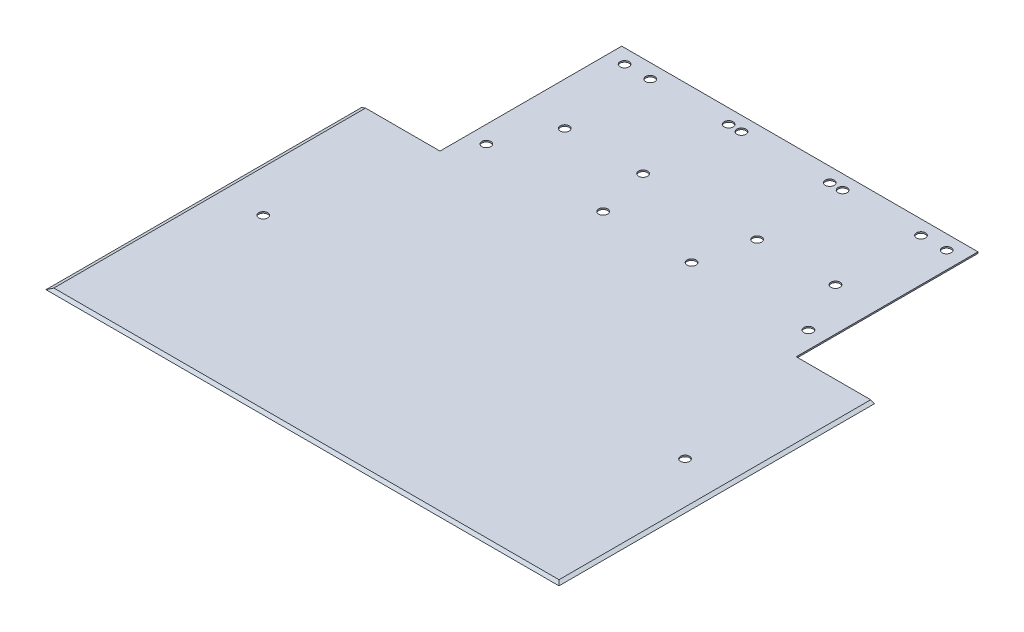
ISO-10303-21;
HEADER;
FILE_DESCRIPTION(('STEP AP214'),'2;1');
FILE_NAME('part.step','',(''),(''),'','','');
FILE_SCHEMA(('AUTOMOTIVE_DESIGN { 1 0 10303 214 1 1 1 1 }'));
ENDSEC;
DATA;
#1=APPLICATION_CONTEXT('core data for automotive mechanical design processes');
#2=APPLICATION_PROTOCOL_DEFINITION('international standard','automotive_design',2000,#1);
#3=PRODUCT_CONTEXT('',#1,'mechanical');
#4=PRODUCT('Part','Part','',(#3));
#5=PRODUCT_RELATED_PRODUCT_CATEGORY('part','',(#4));
#6=PRODUCT_DEFINITION_FORMATION('','',#4);
#7=PRODUCT_DEFINITION_CONTEXT('part definition',#1,'design');
#8=PRODUCT_DEFINITION('design','',#6,#7);
#9=PRODUCT_DEFINITION_SHAPE('','',#8);
#10=(LENGTH_UNIT() NAMED_UNIT(*) SI_UNIT(.MILLI.,.METRE.));
#11=(NAMED_UNIT(*) PLANE_ANGLE_UNIT() SI_UNIT($,.RADIAN.));
#12=(NAMED_UNIT(*) SI_UNIT($,.STERADIAN.) SOLID_ANGLE_UNIT());
#13=UNCERTAINTY_MEASURE_WITH_UNIT(LENGTH_MEASURE(1.E-05),#10,'distance_accuracy_value','');
#14=(GEOMETRIC_REPRESENTATION_CONTEXT(3) GLOBAL_UNCERTAINTY_ASSIGNED_CONTEXT((#13)) GLOBAL_UNIT_ASSIGNED_CONTEXT((#10,
#11,#12)) REPRESENTATION_CONTEXT('',''));
#15=CARTESIAN_POINT('',(0.,0.,0.));
#16=DIRECTION('',(0.,0.,1.));
#17=DIRECTION('',(1.,0.,0.));
#18=AXIS2_PLACEMENT_3D('',#15,#16,#17);
#19=CARTESIAN_POINT('',(90.,0.5,-25.54));
#20=DIRECTION('',(0.,0.,1.));
#21=DIRECTION('',(1.,0.,0.));
#22=AXIS2_PLACEMENT_3D('',#19,#20,#21);
#23=PLANE('',#22);
#24=DIRECTION('',(0.939692620785907,-0.342020143325673,0.));
#25=VECTOR('',#24,1.);
#26=CARTESIAN_POINT('',(88.6262612902727,0.5,-25.54));
#27=LINE('',#26,#25);
#28=CARTESIAN_POINT('',(88.6262612902727,0.5,-25.54));
#29=VERTEX_POINT('',#28);
#30=CARTESIAN_POINT('',(90.,0.,-25.54));
#31=VERTEX_POINT('',#30);
#32=EDGE_CURVE('E120',#29,#31,#27,.T.);
#33=ORIENTED_EDGE('',*,*,#32,.T.);
#34=DIRECTION('',(-1.,0.,0.));
#35=VECTOR('',#34,1.);
#36=CARTESIAN_POINT('',(90.,0.,-25.54));
#37=LINE('',#36,#35);
#38=CARTESIAN_POINT('',(62.5,0.,-25.54));
#39=VERTEX_POINT('',#38);
#40=EDGE_CURVE('E131',#31,#39,#37,.T.);
#41=ORIENTED_EDGE('',*,*,#40,.T.);
#42=DIRECTION('',(0.,-1.,0.));
#43=VECTOR('',#42,1.);
#44=CARTESIAN_POINT('',(62.5,0.5,-25.54));
#45=LINE('',#44,#43);
#46=CARTESIAN_POINT('',(62.5,0.5,-25.54));
#47=VERTEX_POINT('',#46);
#48=EDGE_CURVE('E11',#47,#39,#45,.T.);
#49=ORIENTED_EDGE('',*,*,#48,.F.);
#50=DIRECTION('',(-1.,0.,0.));
#51=VECTOR('',#50,1.);
#52=CARTESIAN_POINT('',(90.,0.5,-25.54));
#53=LINE('',#52,#51);
#54=EDGE_CURVE('E96',#29,#47,#53,.T.);
#55=ORIENTED_EDGE('',*,*,#54,.F.);
#56=EDGE_LOOP('',(#33,#41,#49,#55));
#57=FACE_BOUND('',#56,.T.);
#58=ADVANCED_FACE('F42',(#57),#23,.F.);
#59=CARTESIAN_POINT('',(0.,0.5,0.));
#60=DIRECTION('',(0.,1.,0.));
#61=DIRECTION('',(0.,0.,1.));
#62=AXIS2_PLACEMENT_3D('',#59,#60,#61);
#63=PLANE('',#62);
#64=CARTESIAN_POINT('',(-73.9999999999999,0.5,24.9699409967166));
#65=DIRECTION('',(0.,-1.,0.));
#66=DIRECTION('',(0.,0.,1.));
#67=AXIS2_PLACEMENT_3D('',#64,#65,#66);
#68=CIRCLE('',#67,1.58499999999999);
#69=CARTESIAN_POINT('',(-73.9999999999999,0.5,26.5549409967166));
#70=VERTEX_POINT('',#69);
#71=EDGE_CURVE('E280',#70,#70,#68,.T.);
#72=ORIENTED_EDGE('',*,*,#71,.T.);
#73=EDGE_LOOP('',(#72));
#74=FACE_BOUND('',#73,.T.);
#75=CARTESIAN_POINT('',(73.9999999999999,0.5,24.9699409967166));
#76=DIRECTION('',(0.,1.,0.));
#77=DIRECTION('',(0.,0.,1.));
#78=AXIS2_PLACEMENT_3D('',#75,#76,#77);
#79=CIRCLE('',#78,1.58499999999999);
#80=CARTESIAN_POINT('',(73.9999999999999,0.5,26.5549409967166));
#81=VERTEX_POINT('',#80);
#82=EDGE_CURVE('E277',#81,#81,#79,.T.);
#83=ORIENTED_EDGE('',*,*,#82,.F.);
#84=EDGE_LOOP('',(#83));
#85=FACE_BOUND('',#84,.T.);
#86=CARTESIAN_POINT('',(-56.5,0.5,-84.31));
#87=DIRECTION('',(0.,1.,0.));
#88=DIRECTION('',(0.,0.,1.));
#89=AXIS2_PLACEMENT_3D('',#86,#87,#88);
#90=CIRCLE('',#89,1.58499999999999);
#91=CARTESIAN_POINT('',(-56.5,0.5,-82.725));
#92=VERTEX_POINT('',#91);
#93=EDGE_CURVE('E257',#92,#92,#90,.T.);
#94=ORIENTED_EDGE('',*,*,#93,.F.);
#95=EDGE_LOOP('',(#94));
#96=FACE_BOUND('',#95,.T.);
#97=CARTESIAN_POINT('',(-15.5,0.5,-84.31));
#98=DIRECTION('',(0.,1.,0.));
#99=DIRECTION('',(0.,0.,1.));
#100=AXIS2_PLACEMENT_3D('',#97,#98,#99);
#101=CIRCLE('',#100,1.58499999999999);
#102=CARTESIAN_POINT('',(-15.5,0.5,-82.725));
#103=VERTEX_POINT('',#102);
#104=EDGE_CURVE('E265',#103,#103,#101,.T.);
#105=ORIENTED_EDGE('',*,*,#104,.F.);
#106=EDGE_LOOP('',(#105));
#107=FACE_BOUND('',#106,.T.);
#108=CARTESIAN_POINT('',(-15.5,0.5,-35.8099999999999));
#109=DIRECTION('',(0.,1.,0.));
#110=DIRECTION('',(0.,0.,1.));
#111=AXIS2_PLACEMENT_3D('',#108,#109,#110);
#112=CIRCLE('',#111,1.58499999999999);
#113=CARTESIAN_POINT('',(-15.5,0.5,-34.225));
#114=VERTEX_POINT('',#113);
#115=EDGE_CURVE('E256',#114,#114,#112,.T.);
#116=ORIENTED_EDGE('',*,*,#115,.F.);
#117=EDGE_LOOP('',(#116));
#118=FACE_BOUND('',#117,.T.);
#119=CARTESIAN_POINT('',(-56.5,0.5,-35.8099999999999));
#120=DIRECTION('',(0.,1.,0.));
#121=DIRECTION('',(0.,0.,1.));
#122=AXIS2_PLACEMENT_3D('',#119,#120,#121);
#123=CIRCLE('',#122,1.58499999999999);
#124=CARTESIAN_POINT('',(-56.5,0.5,-34.225));
#125=VERTEX_POINT('',#124);
#126=EDGE_CURVE('E237',#125,#125,#123,.T.);
#127=ORIENTED_EDGE('',*,*,#126,.F.);
#128=EDGE_LOOP('',(#127));
#129=FACE_BOUND('',#128,.T.);
#130=CARTESIAN_POINT('',(56.5,0.5,-84.31));
#131=DIRECTION('',(0.,1.,0.));
#132=DIRECTION('',(0.,0.,1.));
#133=AXIS2_PLACEMENT_3D('',#130,#131,#132);
#134=CIRCLE('',#133,1.58499999999999);
#135=CARTESIAN_POINT('',(56.5,0.5,-82.725));
#136=VERTEX_POINT('',#135);
#137=EDGE_CURVE('E236',#136,#136,#134,.F.);
#138=ORIENTED_EDGE('',*,*,#137,.T.);
#139=EDGE_LOOP('',(#138));
#140=FACE_BOUND('',#139,.T.);
#141=CARTESIAN_POINT('',(15.5,0.5,-84.31));
#142=DIRECTION('',(0.,1.,0.));
#143=DIRECTION('',(0.,0.,1.));
#144=AXIS2_PLACEMENT_3D('',#141,#142,#143);
#145=CIRCLE('',#144,1.58499999999999);
#146=CARTESIAN_POINT('',(15.5,0.5,-82.725));
#147=VERTEX_POINT('',#146);
#148=EDGE_CURVE('E243',#147,#147,#145,.F.);
#149=ORIENTED_EDGE('',*,*,#148,.T.);
#150=EDGE_LOOP('',(#149));
#151=FACE_BOUND('',#150,.T.);
#152=CARTESIAN_POINT('',(15.5,0.5,-35.8099999999999));
#153=DIRECTION('',(0.,1.,0.));
#154=DIRECTION('',(0.,0.,1.));
#155=AXIS2_PLACEMENT_3D('',#152,#153,#154);
#156=CIRCLE('',#155,1.58499999999999);
#157=CARTESIAN_POINT('',(15.5,0.5,-34.225));
#158=VERTEX_POINT('',#157);
#159=EDGE_CURVE('E230',#158,#158,#156,.F.);
#160=ORIENTED_EDGE('',*,*,#159,.T.);
#161=EDGE_LOOP('',(#160));
#162=FACE_BOUND('',#161,.T.);
#163=CARTESIAN_POINT('',(56.5,0.5,-35.8099999999999));
#164=DIRECTION('',(0.,1.,0.));
#165=DIRECTION('',(0.,0.,1.));
#166=AXIS2_PLACEMENT_3D('',#163,#164,#165);
#167=CIRCLE('',#166,1.58499999999999);
#168=CARTESIAN_POINT('',(56.5,0.5,-34.225));
#169=VERTEX_POINT('',#168);
#170=EDGE_CURVE('E227',#169,#169,#167,.F.);
#171=ORIENTED_EDGE('',*,*,#170,.T.);
#172=EDGE_LOOP('',(#171));
#173=FACE_BOUND('',#172,.T.);
#174=CARTESIAN_POINT('',(20.,0.5,-84.3100000000002));
#175=DIRECTION('',(0.,-1.,0.));
#176=DIRECTION('',(0.,0.,1.));
#177=AXIS2_PLACEMENT_3D('',#174,#175,#176);
#178=CIRCLE('',#177,1.58499999999999);
#179=CARTESIAN_POINT('',(20.,0.5,-82.7250000000002));
#180=VERTEX_POINT('',#179);
#181=EDGE_CURVE('E212',#180,#180,#178,.T.);
#182=ORIENTED_EDGE('',*,*,#181,.T.);
#183=EDGE_LOOP('',(#182));
#184=FACE_BOUND('',#183,.T.);
#185=CARTESIAN_POINT('',(47.5,0.5,-84.3099999999997));
#186=DIRECTION('',(0.,-1.,0.));
#187=DIRECTION('',(0.,0.,1.));
#188=AXIS2_PLACEMENT_3D('',#185,#186,#187);
#189=CIRCLE('',#188,1.58499999999999);
#190=CARTESIAN_POINT('',(47.5,0.5,-82.7249999999997));
#191=VERTEX_POINT('',#190);
#192=EDGE_CURVE('E219',#191,#191,#189,.T.);
#193=ORIENTED_EDGE('',*,*,#192,.T.);
#194=EDGE_LOOP('',(#193));
#195=FACE_BOUND('',#194,.T.);
#196=CARTESIAN_POINT('',(47.5,0.5,-54.3100000000003));
#197=DIRECTION('',(0.,-1.,0.));
#198=DIRECTION('',(0.,0.,1.));
#199=AXIS2_PLACEMENT_3D('',#196,#197,#198);
#200=CIRCLE('',#199,1.58499999999999);
#201=CARTESIAN_POINT('',(47.5,0.5,-52.7250000000003));
#202=VERTEX_POINT('',#201);
#203=EDGE_CURVE('E206',#202,#202,#200,.T.);
#204=ORIENTED_EDGE('',*,*,#203,.T.);
#205=EDGE_LOOP('',(#204));
#206=FACE_BOUND('',#205,.T.);
#207=CARTESIAN_POINT('',(20.,0.5,-54.3099999999999));
#208=DIRECTION('',(0.,-1.,0.));
#209=DIRECTION('',(0.,0.,1.));
#210=AXIS2_PLACEMENT_3D('',#207,#208,#209);
#211=CIRCLE('',#210,1.58499999999999);
#212=CARTESIAN_POINT('',(20.,0.5,-52.7249999999999));
#213=VERTEX_POINT('',#212);
#214=EDGE_CURVE('E192',#213,#213,#211,.T.);
#215=ORIENTED_EDGE('',*,*,#214,.T.);
#216=EDGE_LOOP('',(#215));
#217=FACE_BOUND('',#216,.T.);
#218=CARTESIAN_POINT('',(-20.,0.5,-84.3100000000002));
#219=DIRECTION('',(0.,1.,0.));
#220=DIRECTION('',(0.,0.,1.));
#221=AXIS2_PLACEMENT_3D('',#218,#219,#220);
#222=CIRCLE('',#221,1.58499999999999);
#223=CARTESIAN_POINT('',(-20.,0.5,-82.7250000000002));
#224=VERTEX_POINT('',#223);
#225=EDGE_CURVE('E185',#224,#224,#222,.T.);
#226=ORIENTED_EDGE('',*,*,#225,.F.);
#227=EDGE_LOOP('',(#226));
#228=FACE_BOUND('',#227,.T.);
#229=CARTESIAN_POINT('',(-47.5,0.5,-84.3099999999997));
#230=DIRECTION('',(0.,1.,0.));
#231=DIRECTION('',(0.,0.,1.));
#232=AXIS2_PLACEMENT_3D('',#229,#230,#231);
#233=CIRCLE('',#232,1.58499999999999);
#234=CARTESIAN_POINT('',(-47.5,0.5,-82.7249999999997));
#235=VERTEX_POINT('',#234);
#236=EDGE_CURVE('E193',#235,#235,#233,.T.);
#237=ORIENTED_EDGE('',*,*,#236,.F.);
#238=EDGE_LOOP('',(#237));
#239=FACE_BOUND('',#238,.T.);
#240=CARTESIAN_POINT('',(-47.5,0.5,-54.3100000000003));
#241=DIRECTION('',(0.,1.,0.));
#242=DIRECTION('',(0.,0.,1.));
#243=AXIS2_PLACEMENT_3D('',#240,#241,#242);
#244=CIRCLE('',#243,1.58499999999999);
#245=CARTESIAN_POINT('',(-47.5,0.5,-52.7250000000003));
#246=VERTEX_POINT('',#245);
#247=EDGE_CURVE('E184',#246,#246,#244,.T.);
#248=ORIENTED_EDGE('',*,*,#247,.F.);
#249=EDGE_LOOP('',(#248));
#250=FACE_BOUND('',#249,.T.);
#251=CARTESIAN_POINT('',(-20.,0.5,-54.3099999999999));
#252=DIRECTION('',(0.,1.,0.));
#253=DIRECTION('',(0.,0.,1.));
#254=AXIS2_PLACEMENT_3D('',#251,#252,#253);
#255=CIRCLE('',#254,1.58499999999999);
#256=CARTESIAN_POINT('',(-20.,0.5,-52.7249999999999));
#257=VERTEX_POINT('',#256);
#258=EDGE_CURVE('E137',#257,#257,#255,.T.);
#259=ORIENTED_EDGE('',*,*,#258,.F.);
#260=EDGE_LOOP('',(#259));
#261=FACE_BOUND('',#260,.T.);
#262=DIRECTION('',(1.,0.,0.));
#263=VECTOR('',#262,1.);
#264=CARTESIAN_POINT('',(-90.0010000000001,0.5,83.8262612902726));
#265=LINE('',#264,#263);
#266=CARTESIAN_POINT('',(-88.6262612902727,0.5,83.8262612902726));
#267=VERTEX_POINT('',#266);
#268=CARTESIAN_POINT('',(88.6262612902727,0.5,83.8262612902727));
#269=VERTEX_POINT('',#268);
#270=EDGE_CURVE('E284',#267,#269,#265,.T.);
#271=ORIENTED_EDGE('',*,*,#270,.T.);
#272=DIRECTION('',(0.,0.,-1.));
#273=VECTOR('',#272,1.);
#274=CARTESIAN_POINT('',(88.6262612902727,0.5,85.201));
#275=LINE('',#274,#273);
#276=EDGE_CURVE('E56',#269,#29,#275,.T.);
#277=ORIENTED_EDGE('',*,*,#276,.T.);
#278=ORIENTED_EDGE('',*,*,#54,.T.);
#279=DIRECTION('',(0.,0.,-1.));
#280=VECTOR('',#279,1.);
#281=CARTESIAN_POINT('',(62.5,0.5,-25.54));
#282=LINE('',#281,#280);
#283=CARTESIAN_POINT('',(62.5,0.5,-89.31));
#284=VERTEX_POINT('',#283);
#285=EDGE_CURVE('E177',#47,#284,#282,.T.);
#286=ORIENTED_EDGE('',*,*,#285,.T.);
#287=DIRECTION('',(-1.,0.,0.));
#288=VECTOR('',#287,1.);
#289=CARTESIAN_POINT('',(62.5,0.5,-89.31));
#290=LINE('',#289,#288);
#291=CARTESIAN_POINT('',(-62.5,0.5,-89.31));
#292=VERTEX_POINT('',#291);
#293=EDGE_CURVE('E164',#284,#292,#290,.T.);
#294=ORIENTED_EDGE('',*,*,#293,.T.);
#295=DIRECTION('',(0.,0.,1.));
#296=VECTOR('',#295,1.);
#297=CARTESIAN_POINT('',(-62.5,0.5,-25.54));
#298=LINE('',#297,#296);
#299=CARTESIAN_POINT('',(-62.5,0.5,-25.54));
#300=VERTEX_POINT('',#299);
#301=EDGE_CURVE('E65',#292,#300,#298,.T.);
#302=ORIENTED_EDGE('',*,*,#301,.T.);
#303=DIRECTION('',(-1.,0.,0.));
#304=VECTOR('',#303,1.);
#305=CARTESIAN_POINT('',(-90.,0.5,-25.54));
#306=LINE('',#305,#304);
#307=CARTESIAN_POINT('',(-88.6262612902727,0.5,-25.54));
#308=VERTEX_POINT('',#307);
#309=EDGE_CURVE('E140',#300,#308,#306,.T.);
#310=ORIENTED_EDGE('',*,*,#309,.T.);
#311=DIRECTION('',(0.,0.,-1.));
#312=VECTOR('',#311,1.);
#313=CARTESIAN_POINT('',(-88.6262612902727,0.5,85.201));
#314=LINE('',#313,#312);
#315=EDGE_CURVE('E288',#267,#308,#314,.T.);
#316=ORIENTED_EDGE('',*,*,#315,.F.);
#317=EDGE_LOOP('',(#271,#277,#278,#286,#294,#302,#310,#316));
#318=FACE_BOUND('',#317,.T.);
#319=ADVANCED_FACE('F294',(#74,#85,#96,#107,#118,#129,#140,#151,#162,#173,#184,#195,#206,#217,
#228,#239,#250,#261,#318),#63,.T.);
#320=CARTESIAN_POINT('',(-90.0010000000001,0.,85.1999999999999));
#321=DIRECTION('',(0.,-0.939692620785907,-0.342020143325673));
#322=DIRECTION('',(0.,0.342020143325673,-0.939692620785907));
#323=AXIS2_PLACEMENT_3D('',#320,#321,#322);
#324=PLANE('',#323);
#325=DIRECTION('',(-0.684791078771735,0.249243569363958,-0.684791078771735));
#326=VECTOR('',#325,1.);
#327=CARTESIAN_POINT('',(89.2709296407725,0.265359909444579,84.4709296407725));
#328=LINE('',#327,#326);
#329=CARTESIAN_POINT('',(90.,0.,85.2));
#330=VERTEX_POINT('',#329);
#331=EDGE_CURVE('E111',#330,#269,#328,.T.);
#332=ORIENTED_EDGE('',*,*,#331,.T.);
#333=ORIENTED_EDGE('',*,*,#270,.F.);
#334=DIRECTION('',(0.684791078771736,0.249243569363958,-0.684791078771735));
#335=VECTOR('',#334,1.);
#336=CARTESIAN_POINT('',(-89.2709296407726,0.265359909444568,84.4709296407725));
#337=LINE('',#336,#335);
#338=CARTESIAN_POINT('',(-90.,0.,85.2));
#339=VERTEX_POINT('',#338);
#340=EDGE_CURVE('E125',#339,#267,#337,.T.);
#341=ORIENTED_EDGE('',*,*,#340,.F.);
#342=DIRECTION('',(1.,0.,0.));
#343=VECTOR('',#342,1.);
#344=CARTESIAN_POINT('',(90.,0.,85.2));
#345=LINE('',#344,#343);
#346=EDGE_CURVE('E123',#339,#330,#345,.T.);
#347=ORIENTED_EDGE('',*,*,#346,.T.);
#348=EDGE_LOOP('',(#332,#333,#341,#347));
#349=FACE_BOUND('',#348,.T.);
#350=ADVANCED_FACE('F124',(#349),#324,.F.);
#351=CARTESIAN_POINT('',(62.5,0.5,-25.54));
#352=DIRECTION('',(-1.,0.,0.));
#353=DIRECTION('',(0.,0.,1.));
#354=AXIS2_PLACEMENT_3D('',#351,#352,#353);
#355=PLANE('',#354);
#356=DIRECTION('',(0.,0.,-1.));
#357=VECTOR('',#356,1.);
#358=CARTESIAN_POINT('',(62.5,0.,-25.54));
#359=LINE('',#358,#357);
#360=CARTESIAN_POINT('',(62.5,0.,-89.31));
#361=VERTEX_POINT('',#360);
#362=EDGE_CURVE('E134',#39,#361,#359,.T.);
#363=ORIENTED_EDGE('',*,*,#362,.T.);
#364=DIRECTION('',(0.,-1.,0.));
#365=VECTOR('',#364,1.);
#366=CARTESIAN_POINT('',(62.5,0.5,-89.31));
#367=LINE('',#366,#365);
#368=EDGE_CURVE('E49',#284,#361,#367,.T.);
#369=ORIENTED_EDGE('',*,*,#368,.F.);
#370=ORIENTED_EDGE('',*,*,#285,.F.);
#371=ORIENTED_EDGE('',*,*,#48,.T.);
#372=EDGE_LOOP('',(#363,#369,#370,#371));
#373=FACE_BOUND('',#372,.T.);
#374=ADVANCED_FACE('F319',(#373),#355,.F.);
#375=CARTESIAN_POINT('',(62.5,0.5,-89.31));
#376=DIRECTION('',(0.,0.,1.));
#377=DIRECTION('',(1.,0.,0.));
#378=AXIS2_PLACEMENT_3D('',#375,#376,#377);
#379=PLANE('',#378);
#380=DIRECTION('',(-1.,0.,0.));
#381=VECTOR('',#380,1.);
#382=CARTESIAN_POINT('',(62.5,0.,-89.31));
#383=LINE('',#382,#381);
#384=CARTESIAN_POINT('',(-62.5,0.,-89.31));
#385=VERTEX_POINT('',#384);
#386=EDGE_CURVE('E144',#361,#385,#383,.T.);
#387=ORIENTED_EDGE('',*,*,#386,.T.);
#388=DIRECTION('',(0.,-1.,0.));
#389=VECTOR('',#388,1.);
#390=CARTESIAN_POINT('',(-62.5,0.5,-89.31));
#391=LINE('',#390,#389);
#392=EDGE_CURVE('E155',#292,#385,#391,.T.);
#393=ORIENTED_EDGE('',*,*,#392,.F.);
#394=ORIENTED_EDGE('',*,*,#293,.F.);
#395=ORIENTED_EDGE('',*,*,#368,.T.);
#396=EDGE_LOOP('',(#387,#393,#394,#395));
#397=FACE_BOUND('',#396,.T.);
#398=ADVANCED_FACE('F162',(#397),#379,.F.);
#399=CARTESIAN_POINT('',(-62.5,0.5,-25.54));
#400=DIRECTION('',(1.,0.,0.));
#401=DIRECTION('',(0.,0.,-1.));
#402=AXIS2_PLACEMENT_3D('',#399,#400,#401);
#403=PLANE('',#402);
#404=DIRECTION('',(0.,0.,1.));
#405=VECTOR('',#404,1.);
#406=CARTESIAN_POINT('',(-62.5,0.,-25.54));
#407=LINE('',#406,#405);
#408=CARTESIAN_POINT('',(-62.5,0.,-25.54));
#409=VERTEX_POINT('',#408);
#410=EDGE_CURVE('E146',#385,#409,#407,.T.);
#411=ORIENTED_EDGE('',*,*,#410,.T.);
#412=DIRECTION('',(0.,-1.,0.));
#413=VECTOR('',#412,1.);
#414=CARTESIAN_POINT('',(-62.5,0.5,-25.54));
#415=LINE('',#414,#413);
#416=EDGE_CURVE('E152',#300,#409,#415,.T.);
#417=ORIENTED_EDGE('',*,*,#416,.F.);
#418=ORIENTED_EDGE('',*,*,#301,.F.);
#419=ORIENTED_EDGE('',*,*,#392,.T.);
#420=EDGE_LOOP('',(#411,#417,#418,#419));
#421=FACE_BOUND('',#420,.T.);
#422=ADVANCED_FACE('F170',(#421),#403,.F.);
#423=CARTESIAN_POINT('',(-90.,0.5,-25.54));
#424=DIRECTION('',(0.,0.,1.));
#425=DIRECTION('',(1.,0.,0.));
#426=AXIS2_PLACEMENT_3D('',#423,#424,#425);
#427=PLANE('',#426);
#428=DIRECTION('',(-1.,0.,0.));
#429=VECTOR('',#428,1.);
#430=CARTESIAN_POINT('',(-90.,0.,-25.54));
#431=LINE('',#430,#429);
#432=CARTESIAN_POINT('',(-90.,0.,-25.54));
#433=VERTEX_POINT('',#432);
#434=EDGE_CURVE('E148',#409,#433,#431,.T.);
#435=ORIENTED_EDGE('',*,*,#434,.T.);
#436=DIRECTION('',(-0.939692620785907,-0.342020143325673,0.));
#437=VECTOR('',#436,1.);
#438=CARTESIAN_POINT('',(-88.6262612902727,0.5,-25.54));
#439=LINE('',#438,#437);
#440=EDGE_CURVE('E175',#308,#433,#439,.T.);
#441=ORIENTED_EDGE('',*,*,#440,.F.);
#442=ORIENTED_EDGE('',*,*,#309,.F.);
#443=ORIENTED_EDGE('',*,*,#416,.T.);
#444=EDGE_LOOP('',(#435,#441,#442,#443));
#445=FACE_BOUND('',#444,.T.);
#446=ADVANCED_FACE('F173',(#445),#427,.F.);
#447=CARTESIAN_POINT('',(0.,0.,0.));
#448=DIRECTION('',(0.,1.,0.));
#449=DIRECTION('',(0.,0.,1.));
#450=AXIS2_PLACEMENT_3D('',#447,#448,#449);
#451=PLANE('',#450);
#452=CARTESIAN_POINT('',(-73.9999999999999,0.,24.9699409967166));
#453=DIRECTION('',(0.,1.,0.));
#454=DIRECTION('',(0.,0.,1.));
#455=AXIS2_PLACEMENT_3D('',#452,#453,#454);
#456=CIRCLE('',#455,1.58499999999999);
#457=CARTESIAN_POINT('',(-73.9999999999999,0.,26.5549409967166));
#458=VERTEX_POINT('',#457);
#459=EDGE_CURVE('E281',#458,#458,#456,.T.);
#460=ORIENTED_EDGE('',*,*,#459,.T.);
#461=EDGE_LOOP('',(#460));
#462=FACE_BOUND('',#461,.T.);
#463=CARTESIAN_POINT('',(73.9999999999999,0.,24.9699409967166));
#464=DIRECTION('',(0.,1.,0.));
#465=DIRECTION('',(0.,0.,1.));
#466=AXIS2_PLACEMENT_3D('',#463,#464,#465);
#467=CIRCLE('',#466,1.58499999999999);
#468=CARTESIAN_POINT('',(73.9999999999999,0.,26.5549409967166));
#469=VERTEX_POINT('',#468);
#470=EDGE_CURVE('E264',#469,#469,#467,.F.);
#471=ORIENTED_EDGE('',*,*,#470,.F.);
#472=EDGE_LOOP('',(#471));
#473=FACE_BOUND('',#472,.T.);
#474=CARTESIAN_POINT('',(-56.5,0.,-84.31));
#475=DIRECTION('',(0.,1.,0.));
#476=DIRECTION('',(0.,0.,-1.));
#477=AXIS2_PLACEMENT_3D('',#474,#475,#476);
#478=CIRCLE('',#477,1.58499999999999);
#479=CARTESIAN_POINT('',(-56.5,0.,-85.895));
#480=VERTEX_POINT('',#479);
#481=EDGE_CURVE('E261',#480,#480,#478,.T.);
#482=ORIENTED_EDGE('',*,*,#481,.T.);
#483=EDGE_LOOP('',(#482));
#484=FACE_BOUND('',#483,.T.);
#485=CARTESIAN_POINT('',(-15.5,0.,-84.31));
#486=DIRECTION('',(0.,1.,0.));
#487=DIRECTION('',(0.,0.,-1.));
#488=AXIS2_PLACEMENT_3D('',#485,#486,#487);
#489=CIRCLE('',#488,1.58499999999999);
#490=CARTESIAN_POINT('',(-15.5,0.,-85.895));
#491=VERTEX_POINT('',#490);
#492=EDGE_CURVE('E260',#491,#491,#489,.T.);
#493=ORIENTED_EDGE('',*,*,#492,.T.);
#494=EDGE_LOOP('',(#493));
#495=FACE_BOUND('',#494,.T.);
#496=CARTESIAN_POINT('',(-15.5,0.,-35.8099999999999));
#497=DIRECTION('',(0.,1.,0.));
#498=DIRECTION('',(0.,0.,-1.));
#499=AXIS2_PLACEMENT_3D('',#496,#497,#498);
#500=CIRCLE('',#499,1.58499999999999);
#501=CARTESIAN_POINT('',(-15.5,0.,-37.3949999999999));
#502=VERTEX_POINT('',#501);
#503=EDGE_CURVE('E268',#502,#502,#500,.T.);
#504=ORIENTED_EDGE('',*,*,#503,.T.);
#505=EDGE_LOOP('',(#504));
#506=FACE_BOUND('',#505,.T.);
#507=CARTESIAN_POINT('',(-56.5,0.,-35.8099999999999));
#508=DIRECTION('',(0.,1.,0.));
#509=DIRECTION('',(0.,0.,-1.));
#510=AXIS2_PLACEMENT_3D('',#507,#508,#509);
#511=CIRCLE('',#510,1.58499999999999);
#512=CARTESIAN_POINT('',(-56.5,0.,-37.3949999999999));
#513=VERTEX_POINT('',#512);
#514=EDGE_CURVE('E253',#513,#513,#511,.T.);
#515=ORIENTED_EDGE('',*,*,#514,.T.);
#516=EDGE_LOOP('',(#515));
#517=FACE_BOUND('',#516,.T.);
#518=CARTESIAN_POINT('',(56.5,0.,-84.31));
#519=DIRECTION('',(0.,-1.,0.));
#520=DIRECTION('',(0.,0.,-1.));
#521=AXIS2_PLACEMENT_3D('',#518,#519,#520);
#522=CIRCLE('',#521,1.58499999999999);
#523=CARTESIAN_POINT('',(56.5,0.,-85.895));
#524=VERTEX_POINT('',#523);
#525=EDGE_CURVE('E233',#524,#524,#522,.T.);
#526=ORIENTED_EDGE('',*,*,#525,.F.);
#527=EDGE_LOOP('',(#526));
#528=FACE_BOUND('',#527,.T.);
#529=CARTESIAN_POINT('',(15.5,0.,-84.31));
#530=DIRECTION('',(0.,-1.,0.));
#531=DIRECTION('',(0.,0.,-1.));
#532=AXIS2_PLACEMENT_3D('',#529,#530,#531);
#533=CIRCLE('',#532,1.58499999999999);
#534=CARTESIAN_POINT('',(15.5,0.,-85.895));
#535=VERTEX_POINT('',#534);
#536=EDGE_CURVE('E240',#535,#535,#533,.T.);
#537=ORIENTED_EDGE('',*,*,#536,.F.);
#538=EDGE_LOOP('',(#537));
#539=FACE_BOUND('',#538,.T.);
#540=CARTESIAN_POINT('',(15.5,0.,-35.8099999999999));
#541=DIRECTION('',(0.,-1.,0.));
#542=DIRECTION('',(0.,0.,-1.));
#543=AXIS2_PLACEMENT_3D('',#540,#541,#542);
#544=CIRCLE('',#543,1.58499999999999);
#545=CARTESIAN_POINT('',(15.5,0.,-37.3949999999999));
#546=VERTEX_POINT('',#545);
#547=EDGE_CURVE('E246',#546,#546,#544,.T.);
#548=ORIENTED_EDGE('',*,*,#547,.F.);
#549=EDGE_LOOP('',(#548));
#550=FACE_BOUND('',#549,.T.);
#551=CARTESIAN_POINT('',(56.5,0.,-35.8099999999999));
#552=DIRECTION('',(0.,-1.,0.));
#553=DIRECTION('',(0.,0.,-1.));
#554=AXIS2_PLACEMENT_3D('',#551,#552,#553);
#555=CIRCLE('',#554,1.58499999999999);
#556=CARTESIAN_POINT('',(56.5,0.,-37.3949999999999));
#557=VERTEX_POINT('',#556);
#558=EDGE_CURVE('E213',#557,#557,#555,.T.);
#559=ORIENTED_EDGE('',*,*,#558,.F.);
#560=EDGE_LOOP('',(#559));
#561=FACE_BOUND('',#560,.T.);
#562=CARTESIAN_POINT('',(20.,0.,-84.3100000000002));
#563=DIRECTION('',(0.,1.,0.));
#564=DIRECTION('',(0.,0.,1.));
#565=AXIS2_PLACEMENT_3D('',#562,#563,#564);
#566=CIRCLE('',#565,1.58499999999999);
#567=CARTESIAN_POINT('',(20.,0.,-82.7250000000002));
#568=VERTEX_POINT('',#567);
#569=EDGE_CURVE('E209',#568,#568,#566,.T.);
#570=ORIENTED_EDGE('',*,*,#569,.T.);
#571=EDGE_LOOP('',(#570));
#572=FACE_BOUND('',#571,.T.);
#573=CARTESIAN_POINT('',(47.5,0.,-84.3099999999997));
#574=DIRECTION('',(0.,1.,0.));
#575=DIRECTION('',(0.,0.,1.));
#576=AXIS2_PLACEMENT_3D('',#573,#574,#575);
#577=CIRCLE('',#576,1.58499999999999);
#578=CARTESIAN_POINT('',(47.5,0.,-82.7249999999997));
#579=VERTEX_POINT('',#578);
#580=EDGE_CURVE('E216',#579,#579,#577,.T.);
#581=ORIENTED_EDGE('',*,*,#580,.T.);
#582=EDGE_LOOP('',(#581));
#583=FACE_BOUND('',#582,.T.);
#584=CARTESIAN_POINT('',(47.5,0.,-54.3100000000003));
#585=DIRECTION('',(0.,1.,0.));
#586=DIRECTION('',(0.,0.,1.));
#587=AXIS2_PLACEMENT_3D('',#584,#585,#586);
#588=CIRCLE('',#587,1.58499999999999);
#589=CARTESIAN_POINT('',(47.5,0.,-52.7250000000003));
#590=VERTEX_POINT('',#589);
#591=EDGE_CURVE('E222',#590,#590,#588,.T.);
#592=ORIENTED_EDGE('',*,*,#591,.T.);
#593=EDGE_LOOP('',(#592));
#594=FACE_BOUND('',#593,.T.);
#595=CARTESIAN_POINT('',(20.,0.,-54.3099999999999));
#596=DIRECTION('',(0.,1.,0.));
#597=DIRECTION('',(0.,0.,1.));
#598=AXIS2_PLACEMENT_3D('',#595,#596,#597);
#599=CIRCLE('',#598,1.58499999999999);
#600=CARTESIAN_POINT('',(20.,0.,-52.7249999999999));
#601=VERTEX_POINT('',#600);
#602=EDGE_CURVE('E203',#601,#601,#599,.T.);
#603=ORIENTED_EDGE('',*,*,#602,.T.);
#604=EDGE_LOOP('',(#603));
#605=FACE_BOUND('',#604,.T.);
#606=CARTESIAN_POINT('',(-20.,0.,-84.3100000000002));
#607=DIRECTION('',(0.,1.,0.));
#608=DIRECTION('',(0.,0.,1.));
#609=AXIS2_PLACEMENT_3D('',#606,#607,#608);
#610=CIRCLE('',#609,1.58499999999999);
#611=CARTESIAN_POINT('',(-20.,0.,-82.7250000000002));
#612=VERTEX_POINT('',#611);
#613=EDGE_CURVE('E189',#612,#612,#610,.F.);
#614=ORIENTED_EDGE('',*,*,#613,.F.);
#615=EDGE_LOOP('',(#614));
#616=FACE_BOUND('',#615,.T.);
#617=CARTESIAN_POINT('',(-47.5,0.,-84.3099999999997));
#618=DIRECTION('',(0.,1.,0.));
#619=DIRECTION('',(0.,0.,1.));
#620=AXIS2_PLACEMENT_3D('',#617,#618,#619);
#621=CIRCLE('',#620,1.58499999999999);
#622=CARTESIAN_POINT('',(-47.5,0.,-82.7249999999997));
#623=VERTEX_POINT('',#622);
#624=EDGE_CURVE('E188',#623,#623,#621,.F.);
#625=ORIENTED_EDGE('',*,*,#624,.F.);
#626=EDGE_LOOP('',(#625));
#627=FACE_BOUND('',#626,.T.);
#628=CARTESIAN_POINT('',(-47.5,0.,-54.3100000000003));
#629=DIRECTION('',(0.,1.,0.));
#630=DIRECTION('',(0.,0.,1.));
#631=AXIS2_PLACEMENT_3D('',#628,#629,#630);
#632=CIRCLE('',#631,1.58499999999999);
#633=CARTESIAN_POINT('',(-47.5,0.,-52.7250000000003));
#634=VERTEX_POINT('',#633);
#635=EDGE_CURVE('E196',#634,#634,#632,.F.);
#636=ORIENTED_EDGE('',*,*,#635,.F.);
#637=EDGE_LOOP('',(#636));
#638=FACE_BOUND('',#637,.T.);
#639=CARTESIAN_POINT('',(-20.,0.,-54.3099999999999));
#640=DIRECTION('',(0.,1.,0.));
#641=DIRECTION('',(0.,0.,1.));
#642=AXIS2_PLACEMENT_3D('',#639,#640,#641);
#643=CIRCLE('',#642,1.58499999999999);
#644=CARTESIAN_POINT('',(-20.,0.,-52.7249999999999));
#645=VERTEX_POINT('',#644);
#646=EDGE_CURVE('E132',#645,#645,#643,.F.);
#647=ORIENTED_EDGE('',*,*,#646,.F.);
#648=EDGE_LOOP('',(#647));
#649=FACE_BOUND('',#648,.T.);
#650=DIRECTION('',(0.,0.,-1.));
#651=VECTOR('',#650,1.);
#652=CARTESIAN_POINT('',(90.,0.,85.2));
#653=LINE('',#652,#651);
#654=EDGE_CURVE('E115',#330,#31,#653,.T.);
#655=ORIENTED_EDGE('',*,*,#654,.F.);
#656=ORIENTED_EDGE('',*,*,#346,.F.);
#657=DIRECTION('',(0.,0.,1.));
#658=VECTOR('',#657,1.);
#659=CARTESIAN_POINT('',(-90.,0.,85.2));
#660=LINE('',#659,#658);
#661=EDGE_CURVE('E90',#433,#339,#660,.T.);
#662=ORIENTED_EDGE('',*,*,#661,.F.);
#663=ORIENTED_EDGE('',*,*,#434,.F.);
#664=ORIENTED_EDGE('',*,*,#410,.F.);
#665=ORIENTED_EDGE('',*,*,#386,.F.);
#666=ORIENTED_EDGE('',*,*,#362,.F.);
#667=ORIENTED_EDGE('',*,*,#40,.F.);
#668=EDGE_LOOP('',(#655,#656,#662,#663,#664,#665,#666,#667));
#669=FACE_BOUND('',#668,.T.);
#670=ADVANCED_FACE('F129',(#462,#473,#484,#495,#506,#517,#528,#539,#550,#561,#572,#583,#594,
#605,#616,#627,#638,#649,#669),#451,.F.);
#671=CARTESIAN_POINT('',(-20.,-0.00100000000000002,-54.3099999999999));
#672=DIRECTION('',(0.,1.,0.));
#673=DIRECTION('',(0.,0.,1.));
#674=AXIS2_PLACEMENT_3D('',#671,#672,#673);
#675=CYLINDRICAL_SURFACE('',#674,1.58499999999999);
#676=ORIENTED_EDGE('',*,*,#258,.T.);
#677=EDGE_LOOP('',(#676));
#678=FACE_BOUND('',#677,.T.);
#679=ORIENTED_EDGE('',*,*,#646,.T.);
#680=EDGE_LOOP('',(#679));
#681=FACE_BOUND('',#680,.T.);
#682=ADVANCED_FACE('F323',(#678,#681),#675,.F.);
#683=CARTESIAN_POINT('',(-47.5,-0.00100000000000002,-54.3100000000003));
#684=DIRECTION('',(0.,1.,0.));
#685=DIRECTION('',(0.,0.,1.));
#686=AXIS2_PLACEMENT_3D('',#683,#684,#685);
#687=CYLINDRICAL_SURFACE('',#686,1.58499999999999);
#688=ORIENTED_EDGE('',*,*,#247,.T.);
#689=EDGE_LOOP('',(#688));
#690=FACE_BOUND('',#689,.T.);
#691=ORIENTED_EDGE('',*,*,#635,.T.);
#692=EDGE_LOOP('',(#691));
#693=FACE_BOUND('',#692,.T.);
#694=ADVANCED_FACE('F364',(#690,#693),#687,.F.);
#695=CARTESIAN_POINT('',(-47.5,-0.00100000000000002,-84.3099999999997));
#696=DIRECTION('',(0.,1.,0.));
#697=DIRECTION('',(0.,0.,1.));
#698=AXIS2_PLACEMENT_3D('',#695,#696,#697);
#699=CYLINDRICAL_SURFACE('',#698,1.58499999999999);
#700=ORIENTED_EDGE('',*,*,#236,.T.);
#701=EDGE_LOOP('',(#700));
#702=FACE_BOUND('',#701,.T.);
#703=ORIENTED_EDGE('',*,*,#624,.T.);
#704=EDGE_LOOP('',(#703));
#705=FACE_BOUND('',#704,.T.);
#706=ADVANCED_FACE('F371',(#702,#705),#699,.F.);
#707=CARTESIAN_POINT('',(-20.,-0.00100000000000002,-84.3100000000002));
#708=DIRECTION('',(0.,1.,0.));
#709=DIRECTION('',(0.,0.,1.));
#710=AXIS2_PLACEMENT_3D('',#707,#708,#709);
#711=CYLINDRICAL_SURFACE('',#710,1.58499999999999);
#712=ORIENTED_EDGE('',*,*,#225,.T.);
#713=EDGE_LOOP('',(#712));
#714=FACE_BOUND('',#713,.T.);
#715=ORIENTED_EDGE('',*,*,#613,.T.);
#716=EDGE_LOOP('',(#715));
#717=FACE_BOUND('',#716,.T.);
#718=ADVANCED_FACE('F379',(#714,#717),#711,.F.);
#719=CARTESIAN_POINT('',(20.,-0.00100000000000002,-54.3099999999999));
#720=DIRECTION('',(0.,1.,0.));
#721=DIRECTION('',(0.,0.,1.));
#722=AXIS2_PLACEMENT_3D('',#719,#720,#721);
#723=CYLINDRICAL_SURFACE('',#722,1.58499999999999);
#724=ORIENTED_EDGE('',*,*,#214,.F.);
#725=EDGE_LOOP('',(#724));
#726=FACE_BOUND('',#725,.T.);
#727=ORIENTED_EDGE('',*,*,#602,.F.);
#728=EDGE_LOOP('',(#727));
#729=FACE_BOUND('',#728,.T.);
#730=ADVANCED_FACE('F387',(#726,#729),#723,.F.);
#731=CARTESIAN_POINT('',(47.5,-0.00100000000000002,-54.3100000000003));
#732=DIRECTION('',(0.,1.,0.));
#733=DIRECTION('',(0.,0.,1.));
#734=AXIS2_PLACEMENT_3D('',#731,#732,#733);
#735=CYLINDRICAL_SURFACE('',#734,1.58499999999999);
#736=ORIENTED_EDGE('',*,*,#203,.F.);
#737=EDGE_LOOP('',(#736));
#738=FACE_BOUND('',#737,.T.);
#739=ORIENTED_EDGE('',*,*,#591,.F.);
#740=EDGE_LOOP('',(#739));
#741=FACE_BOUND('',#740,.T.);
#742=ADVANCED_FACE('F394',(#738,#741),#735,.F.);
#743=CARTESIAN_POINT('',(47.5,-0.00100000000000002,-84.3099999999997));
#744=DIRECTION('',(0.,1.,0.));
#745=DIRECTION('',(0.,0.,1.));
#746=AXIS2_PLACEMENT_3D('',#743,#744,#745);
#747=CYLINDRICAL_SURFACE('',#746,1.58499999999999);
#748=ORIENTED_EDGE('',*,*,#192,.F.);
#749=EDGE_LOOP('',(#748));
#750=FACE_BOUND('',#749,.T.);
#751=ORIENTED_EDGE('',*,*,#580,.F.);
#752=EDGE_LOOP('',(#751));
#753=FACE_BOUND('',#752,.T.);
#754=ADVANCED_FACE('F402',(#750,#753),#747,.F.);
#755=CARTESIAN_POINT('',(20.,-0.00100000000000002,-84.3100000000002));
#756=DIRECTION('',(0.,1.,0.));
#757=DIRECTION('',(0.,0.,1.));
#758=AXIS2_PLACEMENT_3D('',#755,#756,#757);
#759=CYLINDRICAL_SURFACE('',#758,1.58499999999999);
#760=ORIENTED_EDGE('',*,*,#181,.F.);
#761=EDGE_LOOP('',(#760));
#762=FACE_BOUND('',#761,.T.);
#763=ORIENTED_EDGE('',*,*,#569,.F.);
#764=EDGE_LOOP('',(#763));
#765=FACE_BOUND('',#764,.T.);
#766=ADVANCED_FACE('F410',(#762,#765),#759,.F.);
#767=CARTESIAN_POINT('',(56.5,0.501,-35.8099999999999));
#768=DIRECTION('',(0.,-1.,0.));
#769=DIRECTION('',(0.,0.,-1.));
#770=AXIS2_PLACEMENT_3D('',#767,#768,#769);
#771=CYLINDRICAL_SURFACE('',#770,1.58499999999999);
#772=ORIENTED_EDGE('',*,*,#170,.F.);
#773=EDGE_LOOP('',(#772));
#774=FACE_BOUND('',#773,.T.);
#775=ORIENTED_EDGE('',*,*,#558,.T.);
#776=EDGE_LOOP('',(#775));
#777=FACE_BOUND('',#776,.T.);
#778=ADVANCED_FACE('F418',(#774,#777),#771,.F.);
#779=CARTESIAN_POINT('',(15.5,0.501,-35.8099999999999));
#780=DIRECTION('',(0.,-1.,0.));
#781=DIRECTION('',(0.,0.,-1.));
#782=AXIS2_PLACEMENT_3D('',#779,#780,#781);
#783=CYLINDRICAL_SURFACE('',#782,1.58499999999999);
#784=ORIENTED_EDGE('',*,*,#159,.F.);
#785=EDGE_LOOP('',(#784));
#786=FACE_BOUND('',#785,.T.);
#787=ORIENTED_EDGE('',*,*,#547,.T.);
#788=EDGE_LOOP('',(#787));
#789=FACE_BOUND('',#788,.T.);
#790=ADVANCED_FACE('F426',(#786,#789),#783,.F.);
#791=CARTESIAN_POINT('',(15.5,0.501,-84.31));
#792=DIRECTION('',(0.,-1.,0.));
#793=DIRECTION('',(0.,0.,-1.));
#794=AXIS2_PLACEMENT_3D('',#791,#792,#793);
#795=CYLINDRICAL_SURFACE('',#794,1.58499999999999);
#796=ORIENTED_EDGE('',*,*,#148,.F.);
#797=EDGE_LOOP('',(#796));
#798=FACE_BOUND('',#797,.T.);
#799=ORIENTED_EDGE('',*,*,#536,.T.);
#800=EDGE_LOOP('',(#799));
#801=FACE_BOUND('',#800,.T.);
#802=ADVANCED_FACE('F434',(#798,#801),#795,.F.);
#803=CARTESIAN_POINT('',(56.5,0.501,-84.31));
#804=DIRECTION('',(0.,-1.,0.));
#805=DIRECTION('',(0.,0.,-1.));
#806=AXIS2_PLACEMENT_3D('',#803,#804,#805);
#807=CYLINDRICAL_SURFACE('',#806,1.58499999999999);
#808=ORIENTED_EDGE('',*,*,#137,.F.);
#809=EDGE_LOOP('',(#808));
#810=FACE_BOUND('',#809,.T.);
#811=ORIENTED_EDGE('',*,*,#525,.T.);
#812=EDGE_LOOP('',(#811));
#813=FACE_BOUND('',#812,.T.);
#814=ADVANCED_FACE('F442',(#810,#813),#807,.F.);
#815=CARTESIAN_POINT('',(-56.5,0.501,-35.8099999999999));
#816=DIRECTION('',(0.,-1.,0.));
#817=DIRECTION('',(0.,0.,-1.));
#818=AXIS2_PLACEMENT_3D('',#815,#816,#817);
#819=CYLINDRICAL_SURFACE('',#818,1.58499999999999);
#820=ORIENTED_EDGE('',*,*,#126,.T.);
#821=EDGE_LOOP('',(#820));
#822=FACE_BOUND('',#821,.T.);
#823=ORIENTED_EDGE('',*,*,#514,.F.);
#824=EDGE_LOOP('',(#823));
#825=FACE_BOUND('',#824,.T.);
#826=ADVANCED_FACE('F450',(#822,#825),#819,.F.);
#827=CARTESIAN_POINT('',(-15.5,0.501,-35.8099999999999));
#828=DIRECTION('',(0.,-1.,0.));
#829=DIRECTION('',(0.,0.,-1.));
#830=AXIS2_PLACEMENT_3D('',#827,#828,#829);
#831=CYLINDRICAL_SURFACE('',#830,1.58499999999999);
#832=ORIENTED_EDGE('',*,*,#115,.T.);
#833=EDGE_LOOP('',(#832));
#834=FACE_BOUND('',#833,.T.);
#835=ORIENTED_EDGE('',*,*,#503,.F.);
#836=EDGE_LOOP('',(#835));
#837=FACE_BOUND('',#836,.T.);
#838=ADVANCED_FACE('F458',(#834,#837),#831,.F.);
#839=CARTESIAN_POINT('',(-15.5,0.501,-84.31));
#840=DIRECTION('',(0.,-1.,0.));
#841=DIRECTION('',(0.,0.,-1.));
#842=AXIS2_PLACEMENT_3D('',#839,#840,#841);
#843=CYLINDRICAL_SURFACE('',#842,1.58499999999999);
#844=ORIENTED_EDGE('',*,*,#104,.T.);
#845=EDGE_LOOP('',(#844));
#846=FACE_BOUND('',#845,.T.);
#847=ORIENTED_EDGE('',*,*,#492,.F.);
#848=EDGE_LOOP('',(#847));
#849=FACE_BOUND('',#848,.T.);
#850=ADVANCED_FACE('F466',(#846,#849),#843,.F.);
#851=CARTESIAN_POINT('',(-56.5,0.501,-84.31));
#852=DIRECTION('',(0.,-1.,0.));
#853=DIRECTION('',(0.,0.,-1.));
#854=AXIS2_PLACEMENT_3D('',#851,#852,#853);
#855=CYLINDRICAL_SURFACE('',#854,1.58499999999999);
#856=ORIENTED_EDGE('',*,*,#93,.T.);
#857=EDGE_LOOP('',(#856));
#858=FACE_BOUND('',#857,.T.);
#859=ORIENTED_EDGE('',*,*,#481,.F.);
#860=EDGE_LOOP('',(#859));
#861=FACE_BOUND('',#860,.T.);
#862=ADVANCED_FACE('F474',(#858,#861),#855,.F.);
#863=CARTESIAN_POINT('',(73.9999999999999,-0.00100000000000002,24.9699409967166));
#864=DIRECTION('',(0.,1.,0.));
#865=DIRECTION('',(0.,0.,1.));
#866=AXIS2_PLACEMENT_3D('',#863,#864,#865);
#867=CYLINDRICAL_SURFACE('',#866,1.58499999999999);
#868=ORIENTED_EDGE('',*,*,#82,.T.);
#869=EDGE_LOOP('',(#868));
#870=FACE_BOUND('',#869,.T.);
#871=ORIENTED_EDGE('',*,*,#470,.T.);
#872=EDGE_LOOP('',(#871));
#873=FACE_BOUND('',#872,.T.);
#874=ADVANCED_FACE('F305',(#870,#873),#867,.F.);
#875=CARTESIAN_POINT('',(-73.9999999999999,-0.00100000000000002,24.9699409967166));
#876=DIRECTION('',(0.,1.,0.));
#877=DIRECTION('',(0.,0.,1.));
#878=AXIS2_PLACEMENT_3D('',#875,#876,#877);
#879=CYLINDRICAL_SURFACE('',#878,1.58499999999999);
#880=ORIENTED_EDGE('',*,*,#71,.F.);
#881=EDGE_LOOP('',(#880));
#882=FACE_BOUND('',#881,.T.);
#883=ORIENTED_EDGE('',*,*,#459,.F.);
#884=EDGE_LOOP('',(#883));
#885=FACE_BOUND('',#884,.T.);
#886=ADVANCED_FACE('F297',(#882,#885),#879,.F.);
#887=CARTESIAN_POINT('',(-88.6262612902727,0.5,85.201));
#888=DIRECTION('',(0.342020143325673,-0.939692620785907,0.));
#889=DIRECTION('',(0.939692620785907,0.342020143325673,0.));
#890=AXIS2_PLACEMENT_3D('',#887,#888,#889);
#891=PLANE('',#890);
#892=ORIENTED_EDGE('',*,*,#340,.T.);
#893=ORIENTED_EDGE('',*,*,#315,.T.);
#894=ORIENTED_EDGE('',*,*,#440,.T.);
#895=ORIENTED_EDGE('',*,*,#661,.T.);
#896=EDGE_LOOP('',(#892,#893,#894,#895));
#897=FACE_BOUND('',#896,.T.);
#898=ADVANCED_FACE('F295',(#897),#891,.F.);
#899=CARTESIAN_POINT('',(88.6262612902727,0.5,85.201));
#900=DIRECTION('',(0.342020143325673,0.939692620785907,0.));
#901=DIRECTION('',(-0.939692620785907,0.342020143325673,0.));
#902=AXIS2_PLACEMENT_3D('',#899,#900,#901);
#903=PLANE('',#902);
#904=ORIENTED_EDGE('',*,*,#654,.T.);
#905=ORIENTED_EDGE('',*,*,#32,.F.);
#906=ORIENTED_EDGE('',*,*,#276,.F.);
#907=ORIENTED_EDGE('',*,*,#331,.F.);
#908=EDGE_LOOP('',(#904,#905,#906,#907));
#909=FACE_BOUND('',#908,.T.);
#910=ADVANCED_FACE('F113',(#909),#903,.T.);
#911=CLOSED_SHELL('',(#58,#319,#350,#374,#398,#422,#446,#670,#682,#694,#706,#718,#730,#742,#754,
#766,#778,#790,#802,#814,#826,#838,#850,#862,#874,#886,#898,#910));
#912=MANIFOLD_SOLID_BREP('B2',#911);
#913=ADVANCED_BREP_SHAPE_REPRESENTATION('',(#18,#912),#14);
#914=SHAPE_DEFINITION_REPRESENTATION(#9,#913);
ENDSEC;
END-ISO-10303-21;
